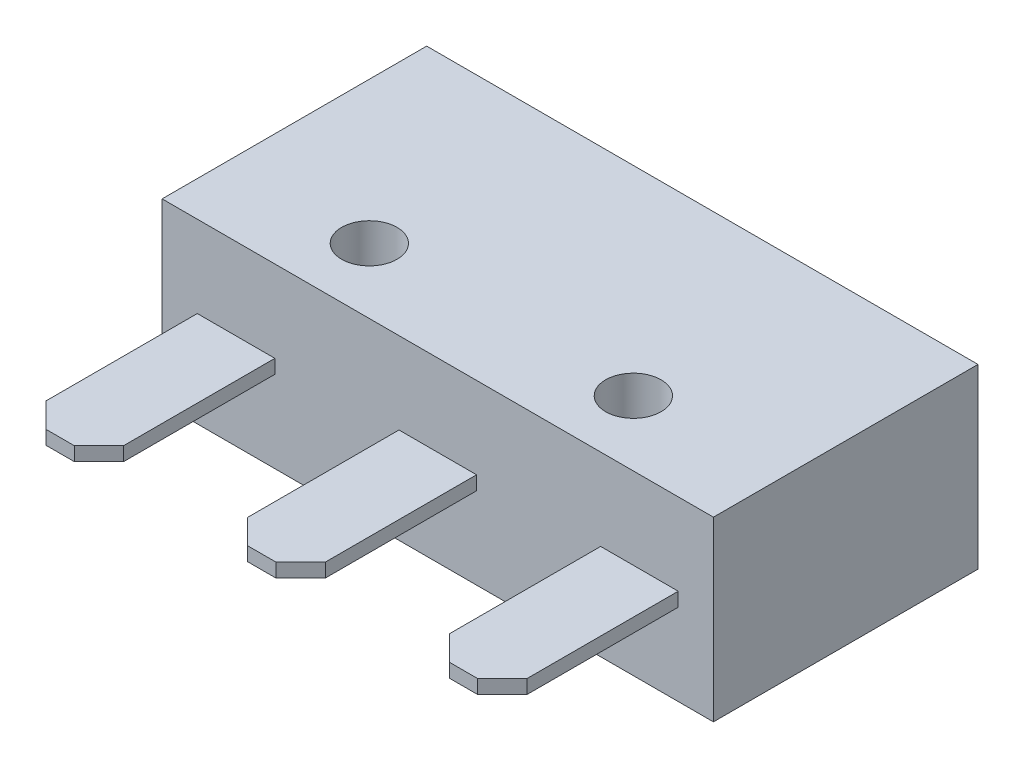
ISO-10303-21;
HEADER;
FILE_DESCRIPTION(('STEP AP214'),'2;1');
FILE_NAME('part.step','',(''),(''),'','','');
FILE_SCHEMA(('AUTOMOTIVE_DESIGN { 1 0 10303 214 1 1 1 1 }'));
ENDSEC;
DATA;
#1=APPLICATION_CONTEXT('core data for automotive mechanical design processes');
#2=APPLICATION_PROTOCOL_DEFINITION('international standard','automotive_design',2000,#1);
#3=PRODUCT_CONTEXT('',#1,'mechanical');
#4=PRODUCT('Part','Part','',(#3));
#5=PRODUCT_RELATED_PRODUCT_CATEGORY('part','',(#4));
#6=PRODUCT_DEFINITION_FORMATION('','',#4);
#7=PRODUCT_DEFINITION_CONTEXT('part definition',#1,'design');
#8=PRODUCT_DEFINITION('design','',#6,#7);
#9=PRODUCT_DEFINITION_SHAPE('','',#8);
#10=(LENGTH_UNIT() NAMED_UNIT(*) SI_UNIT(.MILLI.,.METRE.));
#11=(NAMED_UNIT(*) PLANE_ANGLE_UNIT() SI_UNIT($,.RADIAN.));
#12=(NAMED_UNIT(*) SI_UNIT($,.STERADIAN.) SOLID_ANGLE_UNIT());
#13=UNCERTAINTY_MEASURE_WITH_UNIT(LENGTH_MEASURE(1.E-05),#10,'distance_accuracy_value','');
#14=(GEOMETRIC_REPRESENTATION_CONTEXT(3) GLOBAL_UNCERTAINTY_ASSIGNED_CONTEXT((#13)) GLOBAL_UNIT_ASSIGNED_CONTEXT((#10,
#11,#12)) REPRESENTATION_CONTEXT('',''));
#15=CARTESIAN_POINT('',(0.,0.,0.));
#16=DIRECTION('',(0.,0.,1.));
#17=DIRECTION('',(1.,0.,0.));
#18=AXIS2_PLACEMENT_3D('',#15,#16,#17);
#19=CARTESIAN_POINT('',(0.,6.4,0.));
#20=DIRECTION('',(0.,0.,-1.));
#21=DIRECTION('',(-1.,0.,0.));
#22=AXIS2_PLACEMENT_3D('',#19,#20,#21);
#23=PLANE('',#22);
#24=DIRECTION('',(0.,-1.,0.));
#25=VECTOR('',#24,1.);
#26=CARTESIAN_POINT('',(8.55,3.45,0.));
#27=LINE('',#26,#25);
#28=CARTESIAN_POINT('',(8.55,3.45,0.));
#29=VERTEX_POINT('',#28);
#30=CARTESIAN_POINT('',(8.55,2.95,0.));
#31=VERTEX_POINT('',#30);
#32=EDGE_CURVE('E218',#29,#31,#27,.T.);
#33=ORIENTED_EDGE('',*,*,#32,.F.);
#34=DIRECTION('',(-1.,0.,0.));
#35=VECTOR('',#34,1.);
#36=CARTESIAN_POINT('',(8.55,3.45,0.));
#37=LINE('',#36,#35);
#38=CARTESIAN_POINT('',(11.35,3.45,0.));
#39=VERTEX_POINT('',#38);
#40=EDGE_CURVE('E223',#39,#29,#37,.T.);
#41=ORIENTED_EDGE('',*,*,#40,.F.);
#42=DIRECTION('',(0.,1.,0.));
#43=VECTOR('',#42,1.);
#44=CARTESIAN_POINT('',(11.35,3.45,0.));
#45=LINE('',#44,#43);
#46=CARTESIAN_POINT('',(11.35,2.95,0.));
#47=VERTEX_POINT('',#46);
#48=EDGE_CURVE('E232',#47,#39,#45,.T.);
#49=ORIENTED_EDGE('',*,*,#48,.F.);
#50=DIRECTION('',(1.,0.,0.));
#51=VECTOR('',#50,1.);
#52=CARTESIAN_POINT('',(8.55,2.95,0.));
#53=LINE('',#52,#51);
#54=EDGE_CURVE('E229',#31,#47,#53,.T.);
#55=ORIENTED_EDGE('',*,*,#54,.F.);
#56=EDGE_LOOP('',(#33,#41,#49,#55));
#57=FACE_BOUND('',#56,.T.);
#58=DIRECTION('',(1.,0.,0.));
#59=VECTOR('',#58,1.);
#60=CARTESIAN_POINT('',(0.,0.,0.));
#61=LINE('',#60,#59);
#62=CARTESIAN_POINT('',(0.,0.,0.));
#63=VERTEX_POINT('',#62);
#64=CARTESIAN_POINT('',(19.9,0.,0.));
#65=VERTEX_POINT('',#64);
#66=EDGE_CURVE('E305',#63,#65,#61,.T.);
#67=ORIENTED_EDGE('',*,*,#66,.T.);
#68=DIRECTION('',(0.,-1.,0.));
#69=VECTOR('',#68,1.);
#70=CARTESIAN_POINT('',(19.9,6.4,0.));
#71=LINE('',#70,#69);
#72=CARTESIAN_POINT('',(19.9,6.4,0.));
#73=VERTEX_POINT('',#72);
#74=EDGE_CURVE('E315',#73,#65,#71,.T.);
#75=ORIENTED_EDGE('',*,*,#74,.F.);
#76=DIRECTION('',(1.,0.,0.));
#77=VECTOR('',#76,1.);
#78=CARTESIAN_POINT('',(0.,6.4,0.));
#79=LINE('',#78,#77);
#80=CARTESIAN_POINT('',(0.,6.4,0.));
#81=VERTEX_POINT('',#80);
#82=EDGE_CURVE('E295',#81,#73,#79,.T.);
#83=ORIENTED_EDGE('',*,*,#82,.F.);
#84=DIRECTION('',(0.,-1.,0.));
#85=VECTOR('',#84,1.);
#86=CARTESIAN_POINT('',(0.,6.4,0.));
#87=LINE('',#86,#85);
#88=EDGE_CURVE('E318',#81,#63,#87,.T.);
#89=ORIENTED_EDGE('',*,*,#88,.T.);
#90=EDGE_LOOP('',(#67,#75,#83,#89));
#91=FACE_BOUND('',#90,.T.);
#92=DIRECTION('',(0.,-1.,0.));
#93=VECTOR('',#92,1.);
#94=CARTESIAN_POINT('',(1.27,3.44999999999999,0.));
#95=LINE('',#94,#93);
#96=CARTESIAN_POINT('',(1.27,3.44999999999999,0.));
#97=VERTEX_POINT('',#96);
#98=CARTESIAN_POINT('',(1.27,2.94999999999999,0.));
#99=VERTEX_POINT('',#98);
#100=EDGE_CURVE('E244',#97,#99,#95,.T.);
#101=ORIENTED_EDGE('',*,*,#100,.F.);
#102=DIRECTION('',(-1.,0.,0.));
#103=VECTOR('',#102,1.);
#104=CARTESIAN_POINT('',(1.27,3.44999999999999,0.));
#105=LINE('',#104,#103);
#106=CARTESIAN_POINT('',(4.07,3.45,0.));
#107=VERTEX_POINT('',#106);
#108=EDGE_CURVE('E249',#107,#97,#105,.T.);
#109=ORIENTED_EDGE('',*,*,#108,.F.);
#110=DIRECTION('',(0.,1.,0.));
#111=VECTOR('',#110,1.);
#112=CARTESIAN_POINT('',(4.07,3.45,0.));
#113=LINE('',#112,#111);
#114=CARTESIAN_POINT('',(4.07,2.94999999999999,0.));
#115=VERTEX_POINT('',#114);
#116=EDGE_CURVE('E258',#115,#107,#113,.T.);
#117=ORIENTED_EDGE('',*,*,#116,.F.);
#118=DIRECTION('',(1.,0.,0.));
#119=VECTOR('',#118,1.);
#120=CARTESIAN_POINT('',(1.27,2.94999999999999,0.));
#121=LINE('',#120,#119);
#122=EDGE_CURVE('E255',#99,#115,#121,.T.);
#123=ORIENTED_EDGE('',*,*,#122,.F.);
#124=EDGE_LOOP('',(#101,#109,#117,#123));
#125=FACE_BOUND('',#124,.T.);
#126=DIRECTION('',(0.,-1.,0.));
#127=VECTOR('',#126,1.);
#128=CARTESIAN_POINT('',(15.83,3.44999999999999,0.));
#129=LINE('',#128,#127);
#130=CARTESIAN_POINT('',(15.83,3.44999999999999,0.));
#131=VERTEX_POINT('',#130);
#132=CARTESIAN_POINT('',(15.83,2.95,0.));
#133=VERTEX_POINT('',#132);
#134=EDGE_CURVE('E185',#131,#133,#129,.T.);
#135=ORIENTED_EDGE('',*,*,#134,.F.);
#136=DIRECTION('',(-1.,0.,0.));
#137=VECTOR('',#136,1.);
#138=CARTESIAN_POINT('',(15.83,3.44999999999999,0.));
#139=LINE('',#138,#137);
#140=CARTESIAN_POINT('',(18.63,3.44999999999999,0.));
#141=VERTEX_POINT('',#140);
#142=EDGE_CURVE('E198',#141,#131,#139,.T.);
#143=ORIENTED_EDGE('',*,*,#142,.F.);
#144=DIRECTION('',(0.,1.,0.));
#145=VECTOR('',#144,1.);
#146=CARTESIAN_POINT('',(18.63,3.44999999999999,0.));
#147=LINE('',#146,#145);
#148=CARTESIAN_POINT('',(18.63,2.95000000000001,0.));
#149=VERTEX_POINT('',#148);
#150=EDGE_CURVE('E206',#149,#141,#147,.T.);
#151=ORIENTED_EDGE('',*,*,#150,.F.);
#152=DIRECTION('',(1.,0.,0.));
#153=VECTOR('',#152,1.);
#154=CARTESIAN_POINT('',(15.83,2.95,0.));
#155=LINE('',#154,#153);
#156=EDGE_CURVE('E201',#133,#149,#155,.T.);
#157=ORIENTED_EDGE('',*,*,#156,.F.);
#158=EDGE_LOOP('',(#135,#143,#151,#157));
#159=FACE_BOUND('',#158,.T.);
#160=ADVANCED_FACE('F32',(#57,#91,#125,#159),#23,.F.);
#161=CARTESIAN_POINT('',(7.1,3.2,-10.4136));
#162=DIRECTION('',(0.,0.,1.));
#163=DIRECTION('',(1.,0.,0.));
#164=AXIS2_PLACEMENT_3D('',#161,#162,#163);
#165=CYLINDRICAL_SURFACE('',#164,1.575054);
#166=CARTESIAN_POINT('',(7.1,3.2,-9.55));
#167=DIRECTION('',(0.,0.,1.));
#168=DIRECTION('',(1.,0.,0.));
#169=AXIS2_PLACEMENT_3D('',#166,#167,#168);
#170=CIRCLE('',#169,1.575054);
#171=CARTESIAN_POINT('',(8.675054,3.2,-9.55));
#172=VERTEX_POINT('',#171);
#173=EDGE_CURVE('E321',#172,#172,#170,.F.);
#174=ORIENTED_EDGE('',*,*,#173,.T.);
#175=EDGE_LOOP('',(#174));
#176=FACE_BOUND('',#175,.T.);
#177=CARTESIAN_POINT('',(7.1,3.2,-10.0326));
#178=DIRECTION('',(0.,0.,-1.));
#179=DIRECTION('',(-1.,0.,0.));
#180=AXIS2_PLACEMENT_3D('',#177,#178,#179);
#181=CIRCLE('',#180,1.575054);
#182=CARTESIAN_POINT('',(5.524946,3.2,-10.0326));
#183=VERTEX_POINT('',#182);
#184=EDGE_CURVE('E274',#183,#183,#181,.T.);
#185=ORIENTED_EDGE('',*,*,#184,.F.);
#186=EDGE_LOOP('',(#185));
#187=FACE_BOUND('',#186,.T.);
#188=ADVANCED_FACE('F399',(#176,#187),#165,.T.);
#189=CARTESIAN_POINT('',(0.,6.4,0.));
#190=DIRECTION('',(0.,-1.,0.));
#191=DIRECTION('',(0.,0.,-1.));
#192=AXIS2_PLACEMENT_3D('',#189,#190,#191);
#193=PLANE('',#192);
#194=DIRECTION('',(0.,0.,1.));
#195=VECTOR('',#194,1.);
#196=CARTESIAN_POINT('',(0.,6.4,0.));
#197=LINE('',#196,#195);
#198=CARTESIAN_POINT('',(0.,6.4,-9.55));
#199=VERTEX_POINT('',#198);
#200=EDGE_CURVE('E292',#199,#81,#197,.T.);
#201=ORIENTED_EDGE('',*,*,#200,.T.);
#202=ORIENTED_EDGE('',*,*,#82,.T.);
#203=DIRECTION('',(0.,0.,-1.));
#204=VECTOR('',#203,1.);
#205=CARTESIAN_POINT('',(19.9,6.4,0.));
#206=LINE('',#205,#204);
#207=CARTESIAN_POINT('',(19.9,6.4,-9.55));
#208=VERTEX_POINT('',#207);
#209=EDGE_CURVE('E298',#73,#208,#206,.T.);
#210=ORIENTED_EDGE('',*,*,#209,.T.);
#211=DIRECTION('',(-1.,0.,0.));
#212=VECTOR('',#211,1.);
#213=CARTESIAN_POINT('',(0.,6.4,-9.55));
#214=LINE('',#213,#212);
#215=EDGE_CURVE('E300',#208,#199,#214,.T.);
#216=ORIENTED_EDGE('',*,*,#215,.T.);
#217=EDGE_LOOP('',(#201,#202,#210,#216));
#218=FACE_BOUND('',#217,.T.);
#219=CARTESIAN_POINT('',(5.13,6.4,-2.35));
#220=DIRECTION('',(0.,1.,0.));
#221=DIRECTION('',(0.,0.,1.));
#222=AXIS2_PLACEMENT_3D('',#219,#220,#221);
#223=CIRCLE('',#222,1.);
#224=CARTESIAN_POINT('',(5.13,6.4,-1.35));
#225=VERTEX_POINT('',#224);
#226=EDGE_CURVE('E286',#225,#225,#223,.T.);
#227=ORIENTED_EDGE('',*,*,#226,.F.);
#228=EDGE_LOOP('',(#227));
#229=FACE_BOUND('',#228,.T.);
#230=CARTESIAN_POINT('',(14.66,6.4,-2.35));
#231=DIRECTION('',(0.,1.,0.));
#232=DIRECTION('',(0.,0.,1.));
#233=AXIS2_PLACEMENT_3D('',#230,#231,#232);
#234=CIRCLE('',#233,1.);
#235=CARTESIAN_POINT('',(14.66,6.4,-1.35));
#236=VERTEX_POINT('',#235);
#237=EDGE_CURVE('E280',#236,#236,#234,.T.);
#238=ORIENTED_EDGE('',*,*,#237,.F.);
#239=EDGE_LOOP('',(#238));
#240=FACE_BOUND('',#239,.T.);
#241=ADVANCED_FACE('F405',(#218,#229,#240),#193,.F.);
#242=CARTESIAN_POINT('',(0.,0.,0.));
#243=DIRECTION('',(0.,-1.,0.));
#244=DIRECTION('',(0.,0.,-1.));
#245=AXIS2_PLACEMENT_3D('',#242,#243,#244);
#246=PLANE('',#245);
#247=CARTESIAN_POINT('',(5.13,0.,-2.35));
#248=DIRECTION('',(0.,1.,0.));
#249=DIRECTION('',(0.,0.,1.));
#250=AXIS2_PLACEMENT_3D('',#247,#248,#249);
#251=CIRCLE('',#250,1.);
#252=CARTESIAN_POINT('',(5.13,0.,-1.35));
#253=VERTEX_POINT('',#252);
#254=EDGE_CURVE('E283',#253,#253,#251,.T.);
#255=ORIENTED_EDGE('',*,*,#254,.T.);
#256=EDGE_LOOP('',(#255));
#257=FACE_BOUND('',#256,.T.);
#258=DIRECTION('',(0.,0.,1.));
#259=VECTOR('',#258,1.);
#260=CARTESIAN_POINT('',(0.,0.,0.));
#261=LINE('',#260,#259);
#262=CARTESIAN_POINT('',(0.,0.,-9.55));
#263=VERTEX_POINT('',#262);
#264=EDGE_CURVE('E289',#263,#63,#261,.T.);
#265=ORIENTED_EDGE('',*,*,#264,.F.);
#266=DIRECTION('',(-1.,0.,0.));
#267=VECTOR('',#266,1.);
#268=CARTESIAN_POINT('',(0.,0.,-9.55));
#269=LINE('',#268,#267);
#270=CARTESIAN_POINT('',(19.9,0.,-9.55));
#271=VERTEX_POINT('',#270);
#272=EDGE_CURVE('E296',#271,#263,#269,.T.);
#273=ORIENTED_EDGE('',*,*,#272,.F.);
#274=DIRECTION('',(0.,0.,-1.));
#275=VECTOR('',#274,1.);
#276=CARTESIAN_POINT('',(19.9,0.,0.));
#277=LINE('',#276,#275);
#278=EDGE_CURVE('E307',#65,#271,#277,.T.);
#279=ORIENTED_EDGE('',*,*,#278,.F.);
#280=ORIENTED_EDGE('',*,*,#66,.F.);
#281=EDGE_LOOP('',(#265,#273,#279,#280));
#282=FACE_BOUND('',#281,.T.);
#283=CARTESIAN_POINT('',(14.66,0.,-2.35));
#284=DIRECTION('',(0.,1.,0.));
#285=DIRECTION('',(0.,0.,1.));
#286=AXIS2_PLACEMENT_3D('',#283,#284,#285);
#287=CIRCLE('',#286,1.);
#288=CARTESIAN_POINT('',(14.66,0.,-1.35));
#289=VERTEX_POINT('',#288);
#290=EDGE_CURVE('E279',#289,#289,#287,.T.);
#291=ORIENTED_EDGE('',*,*,#290,.T.);
#292=EDGE_LOOP('',(#291));
#293=FACE_BOUND('',#292,.T.);
#294=ADVANCED_FACE('F417',(#257,#282,#293),#246,.T.);
#295=CARTESIAN_POINT('',(0.,6.4,0.));
#296=DIRECTION('',(1.,0.,0.));
#297=DIRECTION('',(0.,0.,-1.));
#298=AXIS2_PLACEMENT_3D('',#295,#296,#297);
#299=PLANE('',#298);
#300=ORIENTED_EDGE('',*,*,#264,.T.);
#301=ORIENTED_EDGE('',*,*,#88,.F.);
#302=ORIENTED_EDGE('',*,*,#200,.F.);
#303=DIRECTION('',(0.,-1.,0.));
#304=VECTOR('',#303,1.);
#305=CARTESIAN_POINT('',(0.,6.4,-9.55));
#306=LINE('',#305,#304);
#307=EDGE_CURVE('E302',#199,#263,#306,.T.);
#308=ORIENTED_EDGE('',*,*,#307,.T.);
#309=EDGE_LOOP('',(#300,#301,#302,#308));
#310=FACE_BOUND('',#309,.T.);
#311=ADVANCED_FACE('F414',(#310),#299,.F.);
#312=CARTESIAN_POINT('',(19.9,6.4,0.));
#313=DIRECTION('',(-1.,0.,0.));
#314=DIRECTION('',(0.,0.,1.));
#315=AXIS2_PLACEMENT_3D('',#312,#313,#314);
#316=PLANE('',#315);
#317=ORIENTED_EDGE('',*,*,#278,.T.);
#318=DIRECTION('',(0.,-1.,0.));
#319=VECTOR('',#318,1.);
#320=CARTESIAN_POINT('',(19.9,6.4,-9.55));
#321=LINE('',#320,#319);
#322=EDGE_CURVE('E312',#208,#271,#321,.T.);
#323=ORIENTED_EDGE('',*,*,#322,.F.);
#324=ORIENTED_EDGE('',*,*,#209,.F.);
#325=ORIENTED_EDGE('',*,*,#74,.T.);
#326=EDGE_LOOP('',(#317,#323,#324,#325));
#327=FACE_BOUND('',#326,.T.);
#328=ADVANCED_FACE('F412',(#327),#316,.F.);
#329=CARTESIAN_POINT('',(0.,6.4,-9.55));
#330=DIRECTION('',(0.,0.,1.));
#331=DIRECTION('',(1.,0.,0.));
#332=AXIS2_PLACEMENT_3D('',#329,#330,#331);
#333=PLANE('',#332);
#334=ORIENTED_EDGE('',*,*,#173,.F.);
#335=EDGE_LOOP('',(#334));
#336=FACE_BOUND('',#335,.T.);
#337=ORIENTED_EDGE('',*,*,#272,.T.);
#338=ORIENTED_EDGE('',*,*,#307,.F.);
#339=ORIENTED_EDGE('',*,*,#215,.F.);
#340=ORIENTED_EDGE('',*,*,#322,.T.);
#341=EDGE_LOOP('',(#337,#338,#339,#340));
#342=FACE_BOUND('',#341,.T.);
#343=ADVANCED_FACE('F498',(#336,#342),#333,.F.);
#344=CARTESIAN_POINT('',(5.13,6.4,-2.35));
#345=DIRECTION('',(0.,-1.,0.));
#346=DIRECTION('',(0.,0.,-1.));
#347=AXIS2_PLACEMENT_3D('',#344,#345,#346);
#348=CYLINDRICAL_SURFACE('',#347,1.);
#349=ORIENTED_EDGE('',*,*,#226,.T.);
#350=EDGE_LOOP('',(#349));
#351=FACE_BOUND('',#350,.T.);
#352=ORIENTED_EDGE('',*,*,#254,.F.);
#353=EDGE_LOOP('',(#352));
#354=FACE_BOUND('',#353,.T.);
#355=ADVANCED_FACE('F494',(#351,#354),#348,.F.);
#356=CARTESIAN_POINT('',(14.66,6.4,-2.35));
#357=DIRECTION('',(0.,-1.,0.));
#358=DIRECTION('',(0.,0.,-1.));
#359=AXIS2_PLACEMENT_3D('',#356,#357,#358);
#360=CYLINDRICAL_SURFACE('',#359,1.);
#361=ORIENTED_EDGE('',*,*,#237,.T.);
#362=EDGE_LOOP('',(#361));
#363=FACE_BOUND('',#362,.T.);
#364=ORIENTED_EDGE('',*,*,#290,.F.);
#365=EDGE_LOOP('',(#364));
#366=FACE_BOUND('',#365,.T.);
#367=ADVANCED_FACE('F487',(#363,#366),#360,.F.);
#368=CARTESIAN_POINT('',(7.1,3.2,-10.0326));
#369=DIRECTION('',(0.,0.,-1.));
#370=DIRECTION('',(-1.,0.,0.));
#371=AXIS2_PLACEMENT_3D('',#368,#369,#370);
#372=PLANE('',#371);
#373=CARTESIAN_POINT('',(7.1,3.2,-10.0326));
#374=DIRECTION('',(0.,0.,-1.));
#375=DIRECTION('',(-1.,0.,0.));
#376=AXIS2_PLACEMENT_3D('',#373,#374,#375);
#377=CIRCLE('',#376,0.79375);
#378=CARTESIAN_POINT('',(6.30625,3.2,-10.0326));
#379=VERTEX_POINT('',#378);
#380=EDGE_CURVE('E271',#379,#379,#377,.T.);
#381=ORIENTED_EDGE('',*,*,#380,.F.);
#382=EDGE_LOOP('',(#381));
#383=FACE_BOUND('',#382,.T.);
#384=ORIENTED_EDGE('',*,*,#184,.T.);
#385=EDGE_LOOP('',(#384));
#386=FACE_BOUND('',#385,.T.);
#387=ADVANCED_FACE('F483',(#383,#386),#372,.T.);
#388=CARTESIAN_POINT('',(7.1,3.2,-10.0326));
#389=DIRECTION('',(0.,0.,-1.));
#390=DIRECTION('',(-1.,0.,0.));
#391=AXIS2_PLACEMENT_3D('',#388,#389,#390);
#392=CYLINDRICAL_SURFACE('',#391,0.79375);
#393=ORIENTED_EDGE('',*,*,#380,.T.);
#394=EDGE_LOOP('',(#393));
#395=FACE_BOUND('',#394,.T.);
#396=CARTESIAN_POINT('',(7.1,3.2,-10.4136));
#397=DIRECTION('',(0.,0.,-1.));
#398=DIRECTION('',(-1.,0.,0.));
#399=AXIS2_PLACEMENT_3D('',#396,#397,#398);
#400=CIRCLE('',#399,0.79375);
#401=CARTESIAN_POINT('',(6.30625,3.2,-10.4136));
#402=VERTEX_POINT('',#401);
#403=EDGE_CURVE('E270',#402,#402,#400,.T.);
#404=ORIENTED_EDGE('',*,*,#403,.F.);
#405=EDGE_LOOP('',(#404));
#406=FACE_BOUND('',#405,.T.);
#407=ADVANCED_FACE('F480',(#395,#406),#392,.T.);
#408=CARTESIAN_POINT('',(7.1,3.2,-10.4136));
#409=DIRECTION('',(0.,0.,-1.));
#410=DIRECTION('',(-1.,0.,0.));
#411=AXIS2_PLACEMENT_3D('',#408,#409,#410);
#412=PLANE('',#411);
#413=ORIENTED_EDGE('',*,*,#403,.T.);
#414=EDGE_LOOP('',(#413));
#415=FACE_BOUND('',#414,.T.);
#416=ADVANCED_FACE('F479',(#415),#412,.T.);
#417=CARTESIAN_POINT('',(1.27,3.44999999999999,6.35));
#418=DIRECTION('',(1.,0.,0.));
#419=DIRECTION('',(0.,0.,-1.));
#420=AXIS2_PLACEMENT_3D('',#417,#418,#419);
#421=PLANE('',#420);
#422=DIRECTION('',(0.,0.,-1.));
#423=VECTOR('',#422,1.);
#424=CARTESIAN_POINT('',(1.27,2.94999999999999,6.35));
#425=LINE('',#424,#423);
#426=CARTESIAN_POINT('',(1.27,2.94999999999999,5.461));
#427=VERTEX_POINT('',#426);
#428=EDGE_CURVE('E268',#427,#99,#425,.T.);
#429=ORIENTED_EDGE('',*,*,#428,.F.);
#430=DIRECTION('',(0.,1.,0.));
#431=VECTOR('',#430,1.);
#432=CARTESIAN_POINT('',(1.27,3.44999999999999,5.461));
#433=LINE('',#432,#431);
#434=CARTESIAN_POINT('',(1.27,3.44999999999999,5.461));
#435=VERTEX_POINT('',#434);
#436=EDGE_CURVE('E11',#427,#435,#433,.T.);
#437=ORIENTED_EDGE('',*,*,#436,.T.);
#438=DIRECTION('',(0.,0.,-1.));
#439=VECTOR('',#438,1.);
#440=CARTESIAN_POINT('',(1.27,3.44999999999999,6.35));
#441=LINE('',#440,#439);
#442=EDGE_CURVE('E252',#435,#97,#441,.T.);
#443=ORIENTED_EDGE('',*,*,#442,.T.);
#444=ORIENTED_EDGE('',*,*,#100,.T.);
#445=EDGE_LOOP('',(#429,#437,#443,#444));
#446=FACE_BOUND('',#445,.T.);
#447=ADVANCED_FACE('F389',(#446),#421,.F.);
#448=CARTESIAN_POINT('',(1.27,2.94999999999999,6.35));
#449=DIRECTION('',(0.,1.,0.));
#450=DIRECTION('',(-1.,0.,0.));
#451=AXIS2_PLACEMENT_3D('',#448,#449,#450);
#452=PLANE('',#451);
#453=DIRECTION('',(0.,0.,-1.));
#454=VECTOR('',#453,1.);
#455=CARTESIAN_POINT('',(4.07,2.94999999999999,6.35));
#456=LINE('',#455,#454);
#457=CARTESIAN_POINT('',(4.07,2.94999999999999,5.461));
#458=VERTEX_POINT('',#457);
#459=EDGE_CURVE('E266',#458,#115,#456,.T.);
#460=ORIENTED_EDGE('',*,*,#459,.F.);
#461=DIRECTION('',(-0.707106781186546,0.,0.707106781186549));
#462=VECTOR('',#461,1.);
#463=CARTESIAN_POINT('',(3.181,2.94999999999999,6.35));
#464=LINE('',#463,#462);
#465=CARTESIAN_POINT('',(3.181,2.94999999999999,6.35));
#466=VERTEX_POINT('',#465);
#467=EDGE_CURVE('E40',#458,#466,#464,.T.);
#468=ORIENTED_EDGE('',*,*,#467,.T.);
#469=DIRECTION('',(1.,0.,0.));
#470=VECTOR('',#469,1.);
#471=CARTESIAN_POINT('',(1.27,2.94999999999999,6.35));
#472=LINE('',#471,#470);
#473=CARTESIAN_POINT('',(2.159,2.94999999999999,6.35));
#474=VERTEX_POINT('',#473);
#475=EDGE_CURVE('E245',#474,#466,#472,.T.);
#476=ORIENTED_EDGE('',*,*,#475,.F.);
#477=DIRECTION('',(-0.707106781186546,0.,-0.707106781186549));
#478=VECTOR('',#477,1.);
#479=CARTESIAN_POINT('',(2.159,2.94999999999999,6.35));
#480=LINE('',#479,#478);
#481=EDGE_CURVE('E47',#474,#427,#480,.T.);
#482=ORIENTED_EDGE('',*,*,#481,.T.);
#483=ORIENTED_EDGE('',*,*,#428,.T.);
#484=ORIENTED_EDGE('',*,*,#122,.T.);
#485=EDGE_LOOP('',(#460,#468,#476,#482,#483,#484));
#486=FACE_BOUND('',#485,.T.);
#487=ADVANCED_FACE('F371',(#486),#452,.F.);
#488=CARTESIAN_POINT('',(4.07,3.45,6.35));
#489=DIRECTION('',(-1.,0.,0.));
#490=DIRECTION('',(0.,0.,1.));
#491=AXIS2_PLACEMENT_3D('',#488,#489,#490);
#492=PLANE('',#491);
#493=DIRECTION('',(0.,0.,-1.));
#494=VECTOR('',#493,1.);
#495=CARTESIAN_POINT('',(4.07,3.45,6.35));
#496=LINE('',#495,#494);
#497=CARTESIAN_POINT('',(4.07,3.45,5.461));
#498=VERTEX_POINT('',#497);
#499=EDGE_CURVE('E264',#498,#107,#496,.T.);
#500=ORIENTED_EDGE('',*,*,#499,.F.);
#501=DIRECTION('',(0.,-1.,0.));
#502=VECTOR('',#501,1.);
#503=CARTESIAN_POINT('',(4.07,2.94999999999999,5.461));
#504=LINE('',#503,#502);
#505=EDGE_CURVE('E55',#498,#458,#504,.T.);
#506=ORIENTED_EDGE('',*,*,#505,.T.);
#507=ORIENTED_EDGE('',*,*,#459,.T.);
#508=ORIENTED_EDGE('',*,*,#116,.T.);
#509=EDGE_LOOP('',(#500,#506,#507,#508));
#510=FACE_BOUND('',#509,.T.);
#511=ADVANCED_FACE('F382',(#510),#492,.F.);
#512=CARTESIAN_POINT('',(1.27,3.44999999999999,6.35));
#513=DIRECTION('',(0.,-1.,0.));
#514=DIRECTION('',(1.,0.,0.));
#515=AXIS2_PLACEMENT_3D('',#512,#513,#514);
#516=PLANE('',#515);
#517=DIRECTION('',(-1.,0.,0.));
#518=VECTOR('',#517,1.);
#519=CARTESIAN_POINT('',(1.27,3.44999999999999,6.35));
#520=LINE('',#519,#518);
#521=CARTESIAN_POINT('',(3.181,3.45,6.35));
#522=VERTEX_POINT('',#521);
#523=CARTESIAN_POINT('',(2.159,3.45,6.35));
#524=VERTEX_POINT('',#523);
#525=EDGE_CURVE('E248',#522,#524,#520,.T.);
#526=ORIENTED_EDGE('',*,*,#525,.F.);
#527=DIRECTION('',(0.707106781186546,0.,-0.707106781186549));
#528=VECTOR('',#527,1.);
#529=CARTESIAN_POINT('',(3.181,3.45,6.35));
#530=LINE('',#529,#528);
#531=EDGE_CURVE('E367',#522,#498,#530,.T.);
#532=ORIENTED_EDGE('',*,*,#531,.T.);
#533=ORIENTED_EDGE('',*,*,#499,.T.);
#534=ORIENTED_EDGE('',*,*,#108,.T.);
#535=ORIENTED_EDGE('',*,*,#442,.F.);
#536=DIRECTION('',(0.707106781186546,0.,0.707106781186549));
#537=VECTOR('',#536,1.);
#538=CARTESIAN_POINT('',(2.159,3.45,6.35));
#539=LINE('',#538,#537);
#540=EDGE_CURVE('E365',#435,#524,#539,.T.);
#541=ORIENTED_EDGE('',*,*,#540,.T.);
#542=EDGE_LOOP('',(#526,#532,#533,#534,#535,#541));
#543=FACE_BOUND('',#542,.T.);
#544=ADVANCED_FACE('F380',(#543),#516,.F.);
#545=CARTESIAN_POINT('',(0.,0.,6.35));
#546=DIRECTION('',(0.,0.,1.));
#547=DIRECTION('',(1.,0.,0.));
#548=AXIS2_PLACEMENT_3D('',#545,#546,#547);
#549=PLANE('',#548);
#550=ORIENTED_EDGE('',*,*,#475,.T.);
#551=DIRECTION('',(0.,1.,0.));
#552=VECTOR('',#551,1.);
#553=CARTESIAN_POINT('',(3.181,3.45,6.35));
#554=LINE('',#553,#552);
#555=EDGE_CURVE('E362',#466,#522,#554,.T.);
#556=ORIENTED_EDGE('',*,*,#555,.T.);
#557=ORIENTED_EDGE('',*,*,#525,.T.);
#558=DIRECTION('',(0.,-1.,0.));
#559=VECTOR('',#558,1.);
#560=CARTESIAN_POINT('',(2.159,2.94999999999999,6.35));
#561=LINE('',#560,#559);
#562=EDGE_CURVE('E359',#524,#474,#561,.T.);
#563=ORIENTED_EDGE('',*,*,#562,.T.);
#564=EDGE_LOOP('',(#550,#556,#557,#563));
#565=FACE_BOUND('',#564,.T.);
#566=ADVANCED_FACE('F375',(#565),#549,.T.);
#567=CARTESIAN_POINT('',(8.55,3.45,6.35));
#568=DIRECTION('',(1.,0.,0.));
#569=DIRECTION('',(0.,0.,-1.));
#570=AXIS2_PLACEMENT_3D('',#567,#568,#569);
#571=PLANE('',#570);
#572=DIRECTION('',(0.,0.,-1.));
#573=VECTOR('',#572,1.);
#574=CARTESIAN_POINT('',(8.55,2.95,6.35));
#575=LINE('',#574,#573);
#576=CARTESIAN_POINT('',(8.55,2.95,5.461));
#577=VERTEX_POINT('',#576);
#578=EDGE_CURVE('E242',#577,#31,#575,.T.);
#579=ORIENTED_EDGE('',*,*,#578,.F.);
#580=DIRECTION('',(0.,1.,0.));
#581=VECTOR('',#580,1.);
#582=CARTESIAN_POINT('',(8.55,3.45,5.461));
#583=LINE('',#582,#581);
#584=CARTESIAN_POINT('',(8.55,3.45,5.461));
#585=VERTEX_POINT('',#584);
#586=EDGE_CURVE('E357',#577,#585,#583,.T.);
#587=ORIENTED_EDGE('',*,*,#586,.T.);
#588=DIRECTION('',(0.,0.,-1.));
#589=VECTOR('',#588,1.);
#590=CARTESIAN_POINT('',(8.55,3.45,6.35));
#591=LINE('',#590,#589);
#592=EDGE_CURVE('E226',#585,#29,#591,.T.);
#593=ORIENTED_EDGE('',*,*,#592,.T.);
#594=ORIENTED_EDGE('',*,*,#32,.T.);
#595=EDGE_LOOP('',(#579,#587,#593,#594));
#596=FACE_BOUND('',#595,.T.);
#597=ADVANCED_FACE('F460',(#596),#571,.F.);
#598=CARTESIAN_POINT('',(8.55,2.95,6.35));
#599=DIRECTION('',(0.,1.,0.));
#600=DIRECTION('',(0.,0.,1.));
#601=AXIS2_PLACEMENT_3D('',#598,#599,#600);
#602=PLANE('',#601);
#603=DIRECTION('',(0.,0.,-1.));
#604=VECTOR('',#603,1.);
#605=CARTESIAN_POINT('',(11.35,2.95,6.35));
#606=LINE('',#605,#604);
#607=CARTESIAN_POINT('',(11.35,2.95,5.461));
#608=VERTEX_POINT('',#607);
#609=EDGE_CURVE('E240',#608,#47,#606,.T.);
#610=ORIENTED_EDGE('',*,*,#609,.F.);
#611=DIRECTION('',(-0.707106781186546,0.,0.707106781186549));
#612=VECTOR('',#611,1.);
#613=CARTESIAN_POINT('',(10.461,2.95,6.35));
#614=LINE('',#613,#612);
#615=CARTESIAN_POINT('',(10.461,2.95,6.35));
#616=VERTEX_POINT('',#615);
#617=EDGE_CURVE('E355',#608,#616,#614,.T.);
#618=ORIENTED_EDGE('',*,*,#617,.T.);
#619=DIRECTION('',(1.,0.,0.));
#620=VECTOR('',#619,1.);
#621=CARTESIAN_POINT('',(8.55,2.95,6.35));
#622=LINE('',#621,#620);
#623=CARTESIAN_POINT('',(9.439,2.95,6.35));
#624=VERTEX_POINT('',#623);
#625=EDGE_CURVE('E219',#624,#616,#622,.T.);
#626=ORIENTED_EDGE('',*,*,#625,.F.);
#627=DIRECTION('',(-0.707106781186546,0.,-0.707106781186549));
#628=VECTOR('',#627,1.);
#629=CARTESIAN_POINT('',(9.439,2.95,6.35));
#630=LINE('',#629,#628);
#631=EDGE_CURVE('E353',#624,#577,#630,.T.);
#632=ORIENTED_EDGE('',*,*,#631,.T.);
#633=ORIENTED_EDGE('',*,*,#578,.T.);
#634=ORIENTED_EDGE('',*,*,#54,.T.);
#635=EDGE_LOOP('',(#610,#618,#626,#632,#633,#634));
#636=FACE_BOUND('',#635,.T.);
#637=ADVANCED_FACE('F457',(#636),#602,.F.);
#638=CARTESIAN_POINT('',(11.35,3.45,6.35));
#639=DIRECTION('',(-1.,0.,0.));
#640=DIRECTION('',(0.,0.,1.));
#641=AXIS2_PLACEMENT_3D('',#638,#639,#640);
#642=PLANE('',#641);
#643=DIRECTION('',(0.,0.,-1.));
#644=VECTOR('',#643,1.);
#645=CARTESIAN_POINT('',(11.35,3.45,6.35));
#646=LINE('',#645,#644);
#647=CARTESIAN_POINT('',(11.35,3.45,5.461));
#648=VERTEX_POINT('',#647);
#649=EDGE_CURVE('E238',#648,#39,#646,.T.);
#650=ORIENTED_EDGE('',*,*,#649,.F.);
#651=DIRECTION('',(0.,-1.,0.));
#652=VECTOR('',#651,1.);
#653=CARTESIAN_POINT('',(11.35,2.95,5.461));
#654=LINE('',#653,#652);
#655=EDGE_CURVE('E351',#648,#608,#654,.T.);
#656=ORIENTED_EDGE('',*,*,#655,.T.);
#657=ORIENTED_EDGE('',*,*,#609,.T.);
#658=ORIENTED_EDGE('',*,*,#48,.T.);
#659=EDGE_LOOP('',(#650,#656,#657,#658));
#660=FACE_BOUND('',#659,.T.);
#661=ADVANCED_FACE('F452',(#660),#642,.F.);
#662=CARTESIAN_POINT('',(8.55,3.45,6.35));
#663=DIRECTION('',(0.,-1.,0.));
#664=DIRECTION('',(0.,0.,-1.));
#665=AXIS2_PLACEMENT_3D('',#662,#663,#664);
#666=PLANE('',#665);
#667=DIRECTION('',(-1.,0.,0.));
#668=VECTOR('',#667,1.);
#669=CARTESIAN_POINT('',(8.55,3.45,6.35));
#670=LINE('',#669,#668);
#671=CARTESIAN_POINT('',(10.461,3.45,6.35));
#672=VERTEX_POINT('',#671);
#673=CARTESIAN_POINT('',(9.439,3.45,6.35));
#674=VERTEX_POINT('',#673);
#675=EDGE_CURVE('E222',#672,#674,#670,.T.);
#676=ORIENTED_EDGE('',*,*,#675,.F.);
#677=DIRECTION('',(0.707106781186546,0.,-0.707106781186549));
#678=VECTOR('',#677,1.);
#679=CARTESIAN_POINT('',(10.461,3.45,6.35));
#680=LINE('',#679,#678);
#681=EDGE_CURVE('E349',#672,#648,#680,.T.);
#682=ORIENTED_EDGE('',*,*,#681,.T.);
#683=ORIENTED_EDGE('',*,*,#649,.T.);
#684=ORIENTED_EDGE('',*,*,#40,.T.);
#685=ORIENTED_EDGE('',*,*,#592,.F.);
#686=DIRECTION('',(0.707106781186546,0.,0.707106781186549));
#687=VECTOR('',#686,1.);
#688=CARTESIAN_POINT('',(9.439,3.45,6.35));
#689=LINE('',#688,#687);
#690=EDGE_CURVE('E347',#585,#674,#689,.T.);
#691=ORIENTED_EDGE('',*,*,#690,.T.);
#692=EDGE_LOOP('',(#676,#682,#683,#684,#685,#691));
#693=FACE_BOUND('',#692,.T.);
#694=ADVANCED_FACE('F442',(#693),#666,.F.);
#695=CARTESIAN_POINT('',(0.,0.,6.35));
#696=DIRECTION('',(0.,0.,1.));
#697=DIRECTION('',(1.,0.,0.));
#698=AXIS2_PLACEMENT_3D('',#695,#696,#697);
#699=PLANE('',#698);
#700=ORIENTED_EDGE('',*,*,#625,.T.);
#701=DIRECTION('',(0.,1.,0.));
#702=VECTOR('',#701,1.);
#703=CARTESIAN_POINT('',(10.461,3.45,6.35));
#704=LINE('',#703,#702);
#705=EDGE_CURVE('E344',#616,#672,#704,.T.);
#706=ORIENTED_EDGE('',*,*,#705,.T.);
#707=ORIENTED_EDGE('',*,*,#675,.T.);
#708=DIRECTION('',(0.,-1.,0.));
#709=VECTOR('',#708,1.);
#710=CARTESIAN_POINT('',(9.439,2.95,6.35));
#711=LINE('',#710,#709);
#712=EDGE_CURVE('E341',#674,#624,#711,.T.);
#713=ORIENTED_EDGE('',*,*,#712,.T.);
#714=EDGE_LOOP('',(#700,#706,#707,#713));
#715=FACE_BOUND('',#714,.T.);
#716=ADVANCED_FACE('F444',(#715),#699,.T.);
#717=CARTESIAN_POINT('',(15.83,3.44999999999999,6.35));
#718=DIRECTION('',(1.,0.,0.));
#719=DIRECTION('',(0.,0.,-1.));
#720=AXIS2_PLACEMENT_3D('',#717,#718,#719);
#721=PLANE('',#720);
#722=DIRECTION('',(0.,0.,-1.));
#723=VECTOR('',#722,1.);
#724=CARTESIAN_POINT('',(15.83,2.95,6.35));
#725=LINE('',#724,#723);
#726=CARTESIAN_POINT('',(15.83,2.95,5.461));
#727=VERTEX_POINT('',#726);
#728=EDGE_CURVE('E216',#727,#133,#725,.T.);
#729=ORIENTED_EDGE('',*,*,#728,.F.);
#730=DIRECTION('',(0.,1.,0.));
#731=VECTOR('',#730,1.);
#732=CARTESIAN_POINT('',(15.83,3.44999999999999,5.461));
#733=LINE('',#732,#731);
#734=CARTESIAN_POINT('',(15.83,3.44999999999999,5.461));
#735=VERTEX_POINT('',#734);
#736=EDGE_CURVE('E187',#727,#735,#733,.T.);
#737=ORIENTED_EDGE('',*,*,#736,.T.);
#738=DIRECTION('',(0.,0.,-1.));
#739=VECTOR('',#738,1.);
#740=CARTESIAN_POINT('',(15.83,3.44999999999999,6.35));
#741=LINE('',#740,#739);
#742=EDGE_CURVE('E181',#735,#131,#741,.T.);
#743=ORIENTED_EDGE('',*,*,#742,.T.);
#744=ORIENTED_EDGE('',*,*,#134,.T.);
#745=EDGE_LOOP('',(#729,#737,#743,#744));
#746=FACE_BOUND('',#745,.T.);
#747=ADVANCED_FACE('F184',(#746),#721,.F.);
#748=CARTESIAN_POINT('',(15.83,2.95,6.35));
#749=DIRECTION('',(0.,1.,0.));
#750=DIRECTION('',(-1.,0.,0.));
#751=AXIS2_PLACEMENT_3D('',#748,#749,#750);
#752=PLANE('',#751);
#753=DIRECTION('',(1.,0.,0.));
#754=VECTOR('',#753,1.);
#755=CARTESIAN_POINT('',(15.83,2.95,6.35));
#756=LINE('',#755,#754);
#757=CARTESIAN_POINT('',(16.719,2.95,6.35));
#758=VERTEX_POINT('',#757);
#759=CARTESIAN_POINT('',(17.741,2.95,6.35));
#760=VERTEX_POINT('',#759);
#761=EDGE_CURVE('E205',#758,#760,#756,.T.);
#762=ORIENTED_EDGE('',*,*,#761,.F.);
#763=DIRECTION('',(-0.707106781186546,0.,-0.707106781186549));
#764=VECTOR('',#763,1.);
#765=CARTESIAN_POINT('',(16.719,2.95,6.35));
#766=LINE('',#765,#764);
#767=EDGE_CURVE('E332',#758,#727,#766,.T.);
#768=ORIENTED_EDGE('',*,*,#767,.T.);
#769=ORIENTED_EDGE('',*,*,#728,.T.);
#770=ORIENTED_EDGE('',*,*,#156,.T.);
#771=DIRECTION('',(0.,0.,-1.));
#772=VECTOR('',#771,1.);
#773=CARTESIAN_POINT('',(18.63,2.95000000000001,6.35));
#774=LINE('',#773,#772);
#775=CARTESIAN_POINT('',(18.63,2.95000000000001,5.461));
#776=VERTEX_POINT('',#775);
#777=EDGE_CURVE('E214',#776,#149,#774,.T.);
#778=ORIENTED_EDGE('',*,*,#777,.F.);
#779=DIRECTION('',(-0.707106781186546,0.,0.707106781186549));
#780=VECTOR('',#779,1.);
#781=CARTESIAN_POINT('',(17.741,2.95,6.35));
#782=LINE('',#781,#780);
#783=EDGE_CURVE('E330',#776,#760,#782,.T.);
#784=ORIENTED_EDGE('',*,*,#783,.T.);
#785=EDGE_LOOP('',(#762,#768,#769,#770,#778,#784));
#786=FACE_BOUND('',#785,.T.);
#787=ADVANCED_FACE('F653',(#786),#752,.F.);
#788=CARTESIAN_POINT('',(18.63,3.44999999999999,6.35));
#789=DIRECTION('',(-1.,0.,0.));
#790=DIRECTION('',(0.,0.,1.));
#791=AXIS2_PLACEMENT_3D('',#788,#789,#790);
#792=PLANE('',#791);
#793=DIRECTION('',(0.,0.,-1.));
#794=VECTOR('',#793,1.);
#795=CARTESIAN_POINT('',(18.63,3.44999999999999,6.35));
#796=LINE('',#795,#794);
#797=CARTESIAN_POINT('',(18.63,3.44999999999999,5.461));
#798=VERTEX_POINT('',#797);
#799=EDGE_CURVE('E191',#798,#141,#796,.T.);
#800=ORIENTED_EDGE('',*,*,#799,.F.);
#801=DIRECTION('',(0.,-1.,0.));
#802=VECTOR('',#801,1.);
#803=CARTESIAN_POINT('',(18.63,2.95000000000001,5.461));
#804=LINE('',#803,#802);
#805=EDGE_CURVE('E339',#798,#776,#804,.T.);
#806=ORIENTED_EDGE('',*,*,#805,.T.);
#807=ORIENTED_EDGE('',*,*,#777,.T.);
#808=ORIENTED_EDGE('',*,*,#150,.T.);
#809=EDGE_LOOP('',(#800,#806,#807,#808));
#810=FACE_BOUND('',#809,.T.);
#811=ADVANCED_FACE('F662',(#810),#792,.F.);
#812=CARTESIAN_POINT('',(15.83,3.44999999999999,6.35));
#813=DIRECTION('',(0.,-1.,0.));
#814=DIRECTION('',(0.,0.,-1.));
#815=AXIS2_PLACEMENT_3D('',#812,#813,#814);
#816=PLANE('',#815);
#817=ORIENTED_EDGE('',*,*,#742,.F.);
#818=DIRECTION('',(0.707106781186546,0.,0.707106781186549));
#819=VECTOR('',#818,1.);
#820=CARTESIAN_POINT('',(16.719,3.44999999999999,6.35));
#821=LINE('',#820,#819);
#822=CARTESIAN_POINT('',(16.719,3.44999999999999,6.35));
#823=VERTEX_POINT('',#822);
#824=EDGE_CURVE('E337',#735,#823,#821,.T.);
#825=ORIENTED_EDGE('',*,*,#824,.T.);
#826=DIRECTION('',(-1.,0.,0.));
#827=VECTOR('',#826,1.);
#828=CARTESIAN_POINT('',(15.83,3.44999999999999,6.35));
#829=LINE('',#828,#827);
#830=CARTESIAN_POINT('',(17.741,3.44999999999999,6.35));
#831=VERTEX_POINT('',#830);
#832=EDGE_CURVE('E192',#831,#823,#829,.T.);
#833=ORIENTED_EDGE('',*,*,#832,.F.);
#834=DIRECTION('',(0.707106781186546,0.,-0.707106781186549));
#835=VECTOR('',#834,1.);
#836=CARTESIAN_POINT('',(17.741,3.44999999999999,6.35));
#837=LINE('',#836,#835);
#838=EDGE_CURVE('E335',#831,#798,#837,.T.);
#839=ORIENTED_EDGE('',*,*,#838,.T.);
#840=ORIENTED_EDGE('',*,*,#799,.T.);
#841=ORIENTED_EDGE('',*,*,#142,.T.);
#842=EDGE_LOOP('',(#817,#825,#833,#839,#840,#841));
#843=FACE_BOUND('',#842,.T.);
#844=ADVANCED_FACE('F203',(#843),#816,.F.);
#845=CARTESIAN_POINT('',(0.,0.,6.35));
#846=DIRECTION('',(0.,0.,1.));
#847=DIRECTION('',(1.,0.,0.));
#848=AXIS2_PLACEMENT_3D('',#845,#846,#847);
#849=PLANE('',#848);
#850=ORIENTED_EDGE('',*,*,#832,.T.);
#851=DIRECTION('',(0.,-1.,0.));
#852=VECTOR('',#851,1.);
#853=CARTESIAN_POINT('',(16.719,2.95,6.35));
#854=LINE('',#853,#852);
#855=EDGE_CURVE('E327',#823,#758,#854,.T.);
#856=ORIENTED_EDGE('',*,*,#855,.T.);
#857=ORIENTED_EDGE('',*,*,#761,.T.);
#858=DIRECTION('',(0.,1.,0.));
#859=VECTOR('',#858,1.);
#860=CARTESIAN_POINT('',(17.741,3.44999999999999,6.35));
#861=LINE('',#860,#859);
#862=EDGE_CURVE('E324',#760,#831,#861,.T.);
#863=ORIENTED_EDGE('',*,*,#862,.T.);
#864=EDGE_LOOP('',(#850,#856,#857,#863));
#865=FACE_BOUND('',#864,.T.);
#866=ADVANCED_FACE('F423',(#865),#849,.T.);
#867=CARTESIAN_POINT('',(16.719,0.,6.35));
#868=DIRECTION('',(-0.707106781186549,0.,0.707106781186546));
#869=DIRECTION('',(0.,1.,0.));
#870=AXIS2_PLACEMENT_3D('',#867,#868,#869);
#871=PLANE('',#870);
#872=ORIENTED_EDGE('',*,*,#824,.F.);
#873=ORIENTED_EDGE('',*,*,#736,.F.);
#874=ORIENTED_EDGE('',*,*,#767,.F.);
#875=ORIENTED_EDGE('',*,*,#855,.F.);
#876=EDGE_LOOP('',(#872,#873,#874,#875));
#877=FACE_BOUND('',#876,.T.);
#878=ADVANCED_FACE('F419',(#877),#871,.T.);
#879=CARTESIAN_POINT('',(17.741,0.,6.35));
#880=DIRECTION('',(0.707106781186549,0.,0.707106781186546));
#881=DIRECTION('',(0.,-1.,0.));
#882=AXIS2_PLACEMENT_3D('',#879,#880,#881);
#883=PLANE('',#882);
#884=ORIENTED_EDGE('',*,*,#783,.F.);
#885=ORIENTED_EDGE('',*,*,#805,.F.);
#886=ORIENTED_EDGE('',*,*,#838,.F.);
#887=ORIENTED_EDGE('',*,*,#862,.F.);
#888=EDGE_LOOP('',(#884,#885,#886,#887));
#889=FACE_BOUND('',#888,.T.);
#890=ADVANCED_FACE('F422',(#889),#883,.T.);
#891=CARTESIAN_POINT('',(10.461,0.,6.35));
#892=DIRECTION('',(0.707106781186549,0.,0.707106781186546));
#893=DIRECTION('',(0.,-1.,0.));
#894=AXIS2_PLACEMENT_3D('',#891,#892,#893);
#895=PLANE('',#894);
#896=ORIENTED_EDGE('',*,*,#617,.F.);
#897=ORIENTED_EDGE('',*,*,#655,.F.);
#898=ORIENTED_EDGE('',*,*,#681,.F.);
#899=ORIENTED_EDGE('',*,*,#705,.F.);
#900=EDGE_LOOP('',(#896,#897,#898,#899));
#901=FACE_BOUND('',#900,.T.);
#902=ADVANCED_FACE('F427',(#901),#895,.T.);
#903=CARTESIAN_POINT('',(9.439,0.,6.35));
#904=DIRECTION('',(-0.707106781186549,0.,0.707106781186546));
#905=DIRECTION('',(0.,1.,0.));
#906=AXIS2_PLACEMENT_3D('',#903,#904,#905);
#907=PLANE('',#906);
#908=ORIENTED_EDGE('',*,*,#690,.F.);
#909=ORIENTED_EDGE('',*,*,#586,.F.);
#910=ORIENTED_EDGE('',*,*,#631,.F.);
#911=ORIENTED_EDGE('',*,*,#712,.F.);
#912=EDGE_LOOP('',(#908,#909,#910,#911));
#913=FACE_BOUND('',#912,.T.);
#914=ADVANCED_FACE('F397',(#913),#907,.T.);
#915=CARTESIAN_POINT('',(3.181,0.,6.35));
#916=DIRECTION('',(0.707106781186549,0.,0.707106781186546));
#917=DIRECTION('',(0.,-1.,0.));
#918=AXIS2_PLACEMENT_3D('',#915,#916,#917);
#919=PLANE('',#918);
#920=ORIENTED_EDGE('',*,*,#467,.F.);
#921=ORIENTED_EDGE('',*,*,#505,.F.);
#922=ORIENTED_EDGE('',*,*,#531,.F.);
#923=ORIENTED_EDGE('',*,*,#555,.F.);
#924=EDGE_LOOP('',(#920,#921,#922,#923));
#925=FACE_BOUND('',#924,.T.);
#926=ADVANCED_FACE('F378',(#925),#919,.T.);
#927=CARTESIAN_POINT('',(2.159,0.,6.35));
#928=DIRECTION('',(-0.707106781186549,0.,0.707106781186546));
#929=DIRECTION('',(0.,1.,0.));
#930=AXIS2_PLACEMENT_3D('',#927,#928,#929);
#931=PLANE('',#930);
#932=ORIENTED_EDGE('',*,*,#540,.F.);
#933=ORIENTED_EDGE('',*,*,#436,.F.);
#934=ORIENTED_EDGE('',*,*,#481,.F.);
#935=ORIENTED_EDGE('',*,*,#562,.F.);
#936=EDGE_LOOP('',(#932,#933,#934,#935));
#937=FACE_BOUND('',#936,.T.);
#938=ADVANCED_FACE('F34',(#937),#931,.T.);
#939=CLOSED_SHELL('',(#160,#188,#241,#294,#311,#328,#343,#355,#367,#387,#407,#416,#447,#487,
#511,#544,#566,#597,#637,#661,#694,#716,#747,#787,#811,#844,#866,#878,#890,#902,#914,#926,#938));
#940=MANIFOLD_SOLID_BREP('B2',#939);
#941=ADVANCED_BREP_SHAPE_REPRESENTATION('',(#18,#940),#14);
#942=SHAPE_DEFINITION_REPRESENTATION(#9,#941);
ENDSEC;
END-ISO-10303-21;
